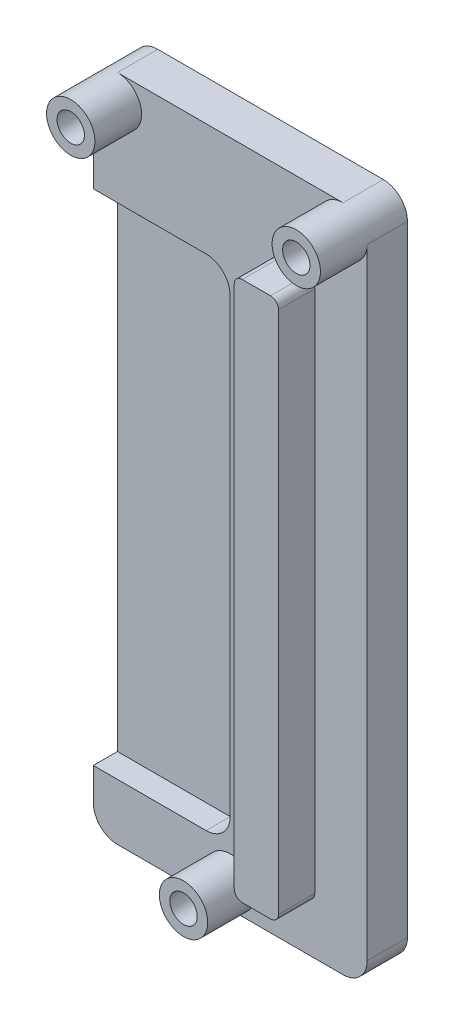
ISO-10303-21;
HEADER;
FILE_DESCRIPTION(('STEP AP214'),'2;1');
FILE_NAME('part.step','',(''),(''),'','','');
FILE_SCHEMA(('AUTOMOTIVE_DESIGN { 1 0 10303 214 1 1 1 1 }'));
ENDSEC;
DATA;
#1=APPLICATION_CONTEXT('core data for automotive mechanical design processes');
#2=APPLICATION_PROTOCOL_DEFINITION('international standard','automotive_design',2000,#1);
#3=PRODUCT_CONTEXT('',#1,'mechanical');
#4=PRODUCT('Part','Part','',(#3));
#5=PRODUCT_RELATED_PRODUCT_CATEGORY('part','',(#4));
#6=PRODUCT_DEFINITION_FORMATION('','',#4);
#7=PRODUCT_DEFINITION_CONTEXT('part definition',#1,'design');
#8=PRODUCT_DEFINITION('design','',#6,#7);
#9=PRODUCT_DEFINITION_SHAPE('','',#8);
#10=(LENGTH_UNIT() NAMED_UNIT(*) SI_UNIT(.MILLI.,.METRE.));
#11=(NAMED_UNIT(*) PLANE_ANGLE_UNIT() SI_UNIT($,.RADIAN.));
#12=(NAMED_UNIT(*) SI_UNIT($,.STERADIAN.) SOLID_ANGLE_UNIT());
#13=UNCERTAINTY_MEASURE_WITH_UNIT(LENGTH_MEASURE(1.E-05),#10,'distance_accuracy_value','');
#14=(GEOMETRIC_REPRESENTATION_CONTEXT(3) GLOBAL_UNCERTAINTY_ASSIGNED_CONTEXT((#13)) GLOBAL_UNIT_ASSIGNED_CONTEXT((#10,
#11,#12)) REPRESENTATION_CONTEXT('',''));
#15=CARTESIAN_POINT('',(0.,0.,0.));
#16=DIRECTION('',(0.,0.,1.));
#17=DIRECTION('',(1.,0.,0.));
#18=AXIS2_PLACEMENT_3D('',#15,#16,#17);
#19=CARTESIAN_POINT('',(3.,3.,5.));
#20=DIRECTION('',(0.,0.,-1.));
#21=DIRECTION('',(-1.,0.,0.));
#22=AXIS2_PLACEMENT_3D('',#19,#20,#21);
#23=PLANE('',#22);
#24=DIRECTION('',(0.,-1.,0.));
#25=VECTOR('',#24,1.);
#26=CARTESIAN_POINT('',(0.,3.,5.));
#27=LINE('',#26,#25);
#28=CARTESIAN_POINT('',(0.,80.,5.));
#29=VERTEX_POINT('',#28);
#30=CARTESIAN_POINT('',(0.,69.,5.));
#31=VERTEX_POINT('',#30);
#32=EDGE_CURVE('E332',#29,#31,#27,.T.);
#33=ORIENTED_EDGE('',*,*,#32,.T.);
#34=DIRECTION('',(-1.,0.,0.));
#35=VECTOR('',#34,1.);
#36=CARTESIAN_POINT('',(14.,69.,5.));
#37=LINE('',#36,#35);
#38=CARTESIAN_POINT('',(14.,69.,5.));
#39=VERTEX_POINT('',#38);
#40=EDGE_CURVE('E207',#39,#31,#37,.T.);
#41=ORIENTED_EDGE('',*,*,#40,.F.);
#42=CARTESIAN_POINT('',(14.,66.,5.));
#43=DIRECTION('',(0.,0.,1.));
#44=DIRECTION('',(-1.,0.,0.));
#45=AXIS2_PLACEMENT_3D('',#42,#43,#44);
#46=CIRCLE('',#45,3.);
#47=CARTESIAN_POINT('',(17.,66.,5.));
#48=VERTEX_POINT('',#47);
#49=EDGE_CURVE('E412',#48,#39,#46,.T.);
#50=ORIENTED_EDGE('',*,*,#49,.F.);
#51=DIRECTION('',(0.,1.,0.));
#52=VECTOR('',#51,1.);
#53=CARTESIAN_POINT('',(17.,66.,5.));
#54=LINE('',#53,#52);
#55=CARTESIAN_POINT('',(17.,10.,5.));
#56=VERTEX_POINT('',#55);
#57=EDGE_CURVE('E415',#56,#48,#54,.T.);
#58=ORIENTED_EDGE('',*,*,#57,.F.);
#59=CARTESIAN_POINT('',(14.,10.,5.));
#60=DIRECTION('',(0.,0.,1.));
#61=DIRECTION('',(-1.,0.,0.));
#62=AXIS2_PLACEMENT_3D('',#59,#60,#61);
#63=CIRCLE('',#62,3.);
#64=CARTESIAN_POINT('',(14.,7.00000000000001,5.));
#65=VERTEX_POINT('',#64);
#66=EDGE_CURVE('E432',#65,#56,#63,.T.);
#67=ORIENTED_EDGE('',*,*,#66,.F.);
#68=DIRECTION('',(1.,0.,0.));
#69=VECTOR('',#68,1.);
#70=CARTESIAN_POINT('',(14.,7.00000000000001,5.));
#71=LINE('',#70,#69);
#72=CARTESIAN_POINT('',(0.,7.00000000000001,5.));
#73=VERTEX_POINT('',#72);
#74=EDGE_CURVE('E434',#73,#65,#71,.T.);
#75=ORIENTED_EDGE('',*,*,#74,.F.);
#76=CARTESIAN_POINT('',(0.,3.,5.));
#77=VERTEX_POINT('',#76);
#78=EDGE_CURVE('E212',#73,#77,#27,.T.);
#79=ORIENTED_EDGE('',*,*,#78,.T.);
#80=CARTESIAN_POINT('',(3.,3.,5.));
#81=DIRECTION('',(0.,0.,1.));
#82=DIRECTION('',(-1.,0.,0.));
#83=AXIS2_PLACEMENT_3D('',#80,#81,#82);
#84=CIRCLE('',#83,3.);
#85=CARTESIAN_POINT('',(3.,0.,5.));
#86=VERTEX_POINT('',#85);
#87=EDGE_CURVE('E317',#77,#86,#84,.T.);
#88=ORIENTED_EDGE('',*,*,#87,.T.);
#89=DIRECTION('',(1.,0.,0.));
#90=VECTOR('',#89,1.);
#91=CARTESIAN_POINT('',(3.,0.,5.));
#92=LINE('',#91,#90);
#93=CARTESIAN_POINT('',(17.,0.,5.));
#94=VERTEX_POINT('',#93);
#95=EDGE_CURVE('E322',#86,#94,#92,.T.);
#96=ORIENTED_EDGE('',*,*,#95,.T.);
#97=CARTESIAN_POINT('',(17.,3.,5.));
#98=DIRECTION('',(0.,0.,1.));
#99=DIRECTION('',(1.,0.,0.));
#100=AXIS2_PLACEMENT_3D('',#97,#98,#99);
#101=CIRCLE('',#100,3.);
#102=EDGE_CURVE('E301',#94,#94,#101,.T.);
#103=ORIENTED_EDGE('',*,*,#102,.F.);
#104=CARTESIAN_POINT('',(31.,0.,5.));
#105=VERTEX_POINT('',#104);
#106=EDGE_CURVE('E320',#94,#105,#92,.T.);
#107=ORIENTED_EDGE('',*,*,#106,.T.);
#108=CARTESIAN_POINT('',(31.,3.,5.));
#109=DIRECTION('',(0.,0.,1.));
#110=DIRECTION('',(1.,0.,0.));
#111=AXIS2_PLACEMENT_3D('',#108,#109,#110);
#112=CIRCLE('',#111,3.);
#113=CARTESIAN_POINT('',(34.,3.,5.));
#114=VERTEX_POINT('',#113);
#115=EDGE_CURVE('E324',#105,#114,#112,.T.);
#116=ORIENTED_EDGE('',*,*,#115,.T.);
#117=DIRECTION('',(0.,1.,0.));
#118=VECTOR('',#117,1.);
#119=CARTESIAN_POINT('',(34.,3.,5.));
#120=LINE('',#119,#118);
#121=CARTESIAN_POINT('',(34.,80.,5.));
#122=VERTEX_POINT('',#121);
#123=EDGE_CURVE('E326',#114,#122,#120,.T.);
#124=ORIENTED_EDGE('',*,*,#123,.T.);
#125=CARTESIAN_POINT('',(31.,80.,5.));
#126=DIRECTION('',(0.,0.,-1.));
#127=DIRECTION('',(-1.,0.,0.));
#128=AXIS2_PLACEMENT_3D('',#125,#126,#127);
#129=CIRCLE('',#128,3.);
#130=CARTESIAN_POINT('',(31.,83.,5.));
#131=VERTEX_POINT('',#130);
#132=EDGE_CURVE('E11',#131,#122,#129,.F.);
#133=ORIENTED_EDGE('',*,*,#132,.F.);
#134=DIRECTION('',(-1.,0.,0.));
#135=VECTOR('',#134,1.);
#136=CARTESIAN_POINT('',(3.,83.,5.));
#137=LINE('',#136,#135);
#138=CARTESIAN_POINT('',(3.,83.,5.));
#139=VERTEX_POINT('',#138);
#140=EDGE_CURVE('E329',#131,#139,#137,.T.);
#141=ORIENTED_EDGE('',*,*,#140,.T.);
#142=CARTESIAN_POINT('',(3.,80.,5.));
#143=DIRECTION('',(0.,0.,1.));
#144=DIRECTION('',(1.,0.,0.));
#145=AXIS2_PLACEMENT_3D('',#142,#143,#144);
#146=CIRCLE('',#145,3.);
#147=EDGE_CURVE('E46',#29,#139,#146,.T.);
#148=ORIENTED_EDGE('',*,*,#147,.F.);
#149=EDGE_LOOP('',(#33,#41,#50,#58,#67,#75,#79,#88,#96,#103,#107,#116,#124,#133,#141,#148));
#150=FACE_BOUND('',#149,.T.);
#151=CARTESIAN_POINT('',(23.,7.,5.));
#152=DIRECTION('',(0.,0.,1.));
#153=DIRECTION('',(1.,0.,0.));
#154=AXIS2_PLACEMENT_3D('',#151,#152,#153);
#155=CIRCLE('',#154,0.999999999999999);
#156=CARTESIAN_POINT('',(22.,7.,5.));
#157=VERTEX_POINT('',#156);
#158=CARTESIAN_POINT('',(23.,6.00000000000001,5.));
#159=VERTEX_POINT('',#158);
#160=EDGE_CURVE('E239',#157,#159,#155,.T.);
#161=ORIENTED_EDGE('',*,*,#160,.F.);
#162=DIRECTION('',(0.,-1.,0.));
#163=VECTOR('',#162,1.);
#164=CARTESIAN_POINT('',(22.,72.,5.));
#165=LINE('',#164,#163);
#166=CARTESIAN_POINT('',(22.,72.,5.));
#167=VERTEX_POINT('',#166);
#168=EDGE_CURVE('E224',#167,#157,#165,.T.);
#169=ORIENTED_EDGE('',*,*,#168,.F.);
#170=CARTESIAN_POINT('',(23.,72.,5.));
#171=DIRECTION('',(0.,0.,1.));
#172=DIRECTION('',(1.,0.,0.));
#173=AXIS2_PLACEMENT_3D('',#170,#171,#172);
#174=CIRCLE('',#173,0.999999999999997);
#175=CARTESIAN_POINT('',(23.,73.,5.));
#176=VERTEX_POINT('',#175);
#177=EDGE_CURVE('E256',#176,#167,#174,.T.);
#178=ORIENTED_EDGE('',*,*,#177,.F.);
#179=DIRECTION('',(-1.,0.,0.));
#180=VECTOR('',#179,1.);
#181=CARTESIAN_POINT('',(23.,73.,5.));
#182=LINE('',#181,#180);
#183=CARTESIAN_POINT('',(26.5,73.,5.));
#184=VERTEX_POINT('',#183);
#185=EDGE_CURVE('E253',#184,#176,#182,.T.);
#186=ORIENTED_EDGE('',*,*,#185,.F.);
#187=CARTESIAN_POINT('',(26.5,72.,5.));
#188=DIRECTION('',(0.,0.,1.));
#189=DIRECTION('',(-1.,0.,0.));
#190=AXIS2_PLACEMENT_3D('',#187,#188,#189);
#191=CIRCLE('',#190,0.999999999999997);
#192=CARTESIAN_POINT('',(27.5,72.,5.));
#193=VERTEX_POINT('',#192);
#194=EDGE_CURVE('E250',#193,#184,#191,.T.);
#195=ORIENTED_EDGE('',*,*,#194,.F.);
#196=DIRECTION('',(0.,1.,0.));
#197=VECTOR('',#196,1.);
#198=CARTESIAN_POINT('',(27.5,72.,5.));
#199=LINE('',#198,#197);
#200=CARTESIAN_POINT('',(27.5,7.,5.));
#201=VERTEX_POINT('',#200);
#202=EDGE_CURVE('E247',#201,#193,#199,.T.);
#203=ORIENTED_EDGE('',*,*,#202,.F.);
#204=CARTESIAN_POINT('',(26.5,7.,5.));
#205=DIRECTION('',(0.,0.,1.));
#206=DIRECTION('',(1.,0.,0.));
#207=AXIS2_PLACEMENT_3D('',#204,#205,#206);
#208=CIRCLE('',#207,0.999999999999999);
#209=CARTESIAN_POINT('',(26.5,6.,5.));
#210=VERTEX_POINT('',#209);
#211=EDGE_CURVE('E244',#210,#201,#208,.T.);
#212=ORIENTED_EDGE('',*,*,#211,.F.);
#213=DIRECTION('',(1.,0.,0.));
#214=VECTOR('',#213,1.);
#215=CARTESIAN_POINT('',(23.,6.00000000000001,5.));
#216=LINE('',#215,#214);
#217=EDGE_CURVE('E61',#159,#210,#216,.T.);
#218=ORIENTED_EDGE('',*,*,#217,.F.);
#219=EDGE_LOOP('',(#161,#169,#178,#186,#195,#203,#212,#218));
#220=FACE_BOUND('',#219,.T.);
#221=ADVANCED_FACE('F38',(#150,#220),#23,.F.);
#222=CARTESIAN_POINT('',(3.,3.,0.));
#223=DIRECTION('',(0.,0.,-1.));
#224=DIRECTION('',(-1.,0.,0.));
#225=AXIS2_PLACEMENT_3D('',#222,#223,#224);
#226=PLANE('',#225);
#227=CARTESIAN_POINT('',(17.,3.,0.));
#228=DIRECTION('',(0.,0.,1.));
#229=DIRECTION('',(1.,0.,0.));
#230=AXIS2_PLACEMENT_3D('',#227,#228,#229);
#231=CIRCLE('',#230,1.7);
#232=CARTESIAN_POINT('',(18.7,3.,0.));
#233=VERTEX_POINT('',#232);
#234=EDGE_CURVE('E298',#233,#233,#231,.T.);
#235=ORIENTED_EDGE('',*,*,#234,.T.);
#236=EDGE_LOOP('',(#235));
#237=FACE_BOUND('',#236,.T.);
#238=CARTESIAN_POINT('',(3.,3.,0.));
#239=DIRECTION('',(0.,0.,1.));
#240=DIRECTION('',(-1.,0.,0.));
#241=AXIS2_PLACEMENT_3D('',#238,#239,#240);
#242=CIRCLE('',#241,3.);
#243=CARTESIAN_POINT('',(0.,3.,0.));
#244=VERTEX_POINT('',#243);
#245=CARTESIAN_POINT('',(3.,0.,0.));
#246=VERTEX_POINT('',#245);
#247=EDGE_CURVE('E313',#244,#246,#242,.T.);
#248=ORIENTED_EDGE('',*,*,#247,.F.);
#249=DIRECTION('',(0.,-1.,0.));
#250=VECTOR('',#249,1.);
#251=CARTESIAN_POINT('',(0.,3.,0.));
#252=LINE('',#251,#250);
#253=CARTESIAN_POINT('',(0.,80.,0.));
#254=VERTEX_POINT('',#253);
#255=EDGE_CURVE('E321',#254,#244,#252,.T.);
#256=ORIENTED_EDGE('',*,*,#255,.F.);
#257=CARTESIAN_POINT('',(3.,80.,0.));
#258=DIRECTION('',(0.,0.,1.));
#259=DIRECTION('',(-1.,0.,0.));
#260=AXIS2_PLACEMENT_3D('',#257,#258,#259);
#261=CIRCLE('',#260,3.);
#262=CARTESIAN_POINT('',(3.,83.,0.));
#263=VERTEX_POINT('',#262);
#264=EDGE_CURVE('E348',#263,#254,#261,.T.);
#265=ORIENTED_EDGE('',*,*,#264,.F.);
#266=DIRECTION('',(-1.,0.,0.));
#267=VECTOR('',#266,1.);
#268=CARTESIAN_POINT('',(3.,83.,0.));
#269=LINE('',#268,#267);
#270=CARTESIAN_POINT('',(31.,83.,0.));
#271=VERTEX_POINT('',#270);
#272=EDGE_CURVE('E346',#271,#263,#269,.T.);
#273=ORIENTED_EDGE('',*,*,#272,.F.);
#274=CARTESIAN_POINT('',(31.,80.,0.));
#275=DIRECTION('',(0.,0.,1.));
#276=DIRECTION('',(1.,0.,0.));
#277=AXIS2_PLACEMENT_3D('',#274,#275,#276);
#278=CIRCLE('',#277,3.);
#279=CARTESIAN_POINT('',(34.,80.,0.));
#280=VERTEX_POINT('',#279);
#281=EDGE_CURVE('E344',#280,#271,#278,.T.);
#282=ORIENTED_EDGE('',*,*,#281,.F.);
#283=DIRECTION('',(0.,1.,0.));
#284=VECTOR('',#283,1.);
#285=CARTESIAN_POINT('',(34.,3.,0.));
#286=LINE('',#285,#284);
#287=CARTESIAN_POINT('',(34.,3.,0.));
#288=VERTEX_POINT('',#287);
#289=EDGE_CURVE('E342',#288,#280,#286,.T.);
#290=ORIENTED_EDGE('',*,*,#289,.F.);
#291=CARTESIAN_POINT('',(31.,3.,0.));
#292=DIRECTION('',(0.,0.,1.));
#293=DIRECTION('',(1.,0.,0.));
#294=AXIS2_PLACEMENT_3D('',#291,#292,#293);
#295=CIRCLE('',#294,3.);
#296=CARTESIAN_POINT('',(31.,0.,0.));
#297=VERTEX_POINT('',#296);
#298=EDGE_CURVE('E340',#297,#288,#295,.T.);
#299=ORIENTED_EDGE('',*,*,#298,.F.);
#300=DIRECTION('',(1.,0.,0.));
#301=VECTOR('',#300,1.);
#302=CARTESIAN_POINT('',(3.,0.,0.));
#303=LINE('',#302,#301);
#304=EDGE_CURVE('E338',#246,#297,#303,.T.);
#305=ORIENTED_EDGE('',*,*,#304,.F.);
#306=EDGE_LOOP('',(#248,#256,#265,#273,#282,#290,#299,#305));
#307=FACE_BOUND('',#306,.T.);
#308=CARTESIAN_POINT('',(31.,80.,0.));
#309=DIRECTION('',(0.,0.,1.));
#310=DIRECTION('',(1.,0.,0.));
#311=AXIS2_PLACEMENT_3D('',#308,#309,#310);
#312=CIRCLE('',#311,1.7);
#313=CARTESIAN_POINT('',(32.7,80.,0.));
#314=VERTEX_POINT('',#313);
#315=EDGE_CURVE('E292',#314,#314,#312,.T.);
#316=ORIENTED_EDGE('',*,*,#315,.T.);
#317=EDGE_LOOP('',(#316));
#318=FACE_BOUND('',#317,.T.);
#319=CARTESIAN_POINT('',(3.,80.,0.));
#320=DIRECTION('',(0.,0.,1.));
#321=DIRECTION('',(1.,0.,0.));
#322=AXIS2_PLACEMENT_3D('',#319,#320,#321);
#323=CIRCLE('',#322,1.7);
#324=CARTESIAN_POINT('',(4.7,80.,0.));
#325=VERTEX_POINT('',#324);
#326=EDGE_CURVE('E286',#325,#325,#323,.T.);
#327=ORIENTED_EDGE('',*,*,#326,.T.);
#328=EDGE_LOOP('',(#327));
#329=FACE_BOUND('',#328,.T.);
#330=ADVANCED_FACE('F381',(#237,#307,#318,#329),#226,.T.);
#331=CARTESIAN_POINT('',(3.,3.,5.));
#332=DIRECTION('',(0.,0.,-1.));
#333=DIRECTION('',(-1.,0.,0.));
#334=AXIS2_PLACEMENT_3D('',#331,#332,#333);
#335=CYLINDRICAL_SURFACE('',#334,3.);
#336=ORIENTED_EDGE('',*,*,#247,.T.);
#337=DIRECTION('',(0.,0.,-1.));
#338=VECTOR('',#337,1.);
#339=CARTESIAN_POINT('',(3.,0.,5.));
#340=LINE('',#339,#338);
#341=EDGE_CURVE('E316',#86,#246,#340,.T.);
#342=ORIENTED_EDGE('',*,*,#341,.F.);
#343=ORIENTED_EDGE('',*,*,#87,.F.);
#344=DIRECTION('',(0.,0.,-1.));
#345=VECTOR('',#344,1.);
#346=CARTESIAN_POINT('',(0.,3.,5.));
#347=LINE('',#346,#345);
#348=EDGE_CURVE('E335',#77,#244,#347,.T.);
#349=ORIENTED_EDGE('',*,*,#348,.T.);
#350=EDGE_LOOP('',(#336,#342,#343,#349));
#351=FACE_BOUND('',#350,.T.);
#352=ADVANCED_FACE('F40',(#351),#335,.T.);
#353=CARTESIAN_POINT('',(3.,0.,5.));
#354=DIRECTION('',(0.,1.,0.));
#355=DIRECTION('',(0.,0.,1.));
#356=AXIS2_PLACEMENT_3D('',#353,#354,#355);
#357=PLANE('',#356);
#358=ORIENTED_EDGE('',*,*,#304,.T.);
#359=DIRECTION('',(0.,0.,-1.));
#360=VECTOR('',#359,1.);
#361=CARTESIAN_POINT('',(31.,0.,5.));
#362=LINE('',#361,#360);
#363=EDGE_CURVE('E368',#105,#297,#362,.T.);
#364=ORIENTED_EDGE('',*,*,#363,.F.);
#365=ORIENTED_EDGE('',*,*,#106,.F.);
#366=ORIENTED_EDGE('',*,*,#95,.F.);
#367=ORIENTED_EDGE('',*,*,#341,.T.);
#368=EDGE_LOOP('',(#358,#364,#365,#366,#367));
#369=FACE_BOUND('',#368,.T.);
#370=ADVANCED_FACE('F373',(#369),#357,.F.);
#371=CARTESIAN_POINT('',(31.,3.,5.));
#372=DIRECTION('',(0.,0.,-1.));
#373=DIRECTION('',(-1.,0.,0.));
#374=AXIS2_PLACEMENT_3D('',#371,#372,#373);
#375=CYLINDRICAL_SURFACE('',#374,3.);
#376=ORIENTED_EDGE('',*,*,#298,.T.);
#377=DIRECTION('',(0.,0.,-1.));
#378=VECTOR('',#377,1.);
#379=CARTESIAN_POINT('',(34.,3.,5.));
#380=LINE('',#379,#378);
#381=EDGE_CURVE('E365',#114,#288,#380,.T.);
#382=ORIENTED_EDGE('',*,*,#381,.F.);
#383=ORIENTED_EDGE('',*,*,#115,.F.);
#384=ORIENTED_EDGE('',*,*,#363,.T.);
#385=EDGE_LOOP('',(#376,#382,#383,#384));
#386=FACE_BOUND('',#385,.T.);
#387=ADVANCED_FACE('F389',(#386),#375,.T.);
#388=CARTESIAN_POINT('',(34.,3.,5.));
#389=DIRECTION('',(-1.,0.,0.));
#390=DIRECTION('',(0.,-1.,0.));
#391=AXIS2_PLACEMENT_3D('',#388,#389,#390);
#392=PLANE('',#391);
#393=ORIENTED_EDGE('',*,*,#289,.T.);
#394=DIRECTION('',(0.,0.,-1.));
#395=VECTOR('',#394,1.);
#396=CARTESIAN_POINT('',(34.,80.,5.));
#397=LINE('',#396,#395);
#398=EDGE_CURVE('E362',#122,#280,#397,.T.);
#399=ORIENTED_EDGE('',*,*,#398,.F.);
#400=ORIENTED_EDGE('',*,*,#123,.F.);
#401=ORIENTED_EDGE('',*,*,#381,.T.);
#402=EDGE_LOOP('',(#393,#399,#400,#401));
#403=FACE_BOUND('',#402,.T.);
#404=ADVANCED_FACE('F393',(#403),#392,.F.);
#405=CARTESIAN_POINT('',(31.,80.,5.));
#406=DIRECTION('',(0.,0.,-1.));
#407=DIRECTION('',(-1.,0.,0.));
#408=AXIS2_PLACEMENT_3D('',#405,#406,#407);
#409=CYLINDRICAL_SURFACE('',#408,3.);
#410=ORIENTED_EDGE('',*,*,#281,.T.);
#411=DIRECTION('',(0.,0.,-1.));
#412=VECTOR('',#411,1.);
#413=CARTESIAN_POINT('',(31.,83.,5.));
#414=LINE('',#413,#412);
#415=EDGE_CURVE('E359',#131,#271,#414,.T.);
#416=ORIENTED_EDGE('',*,*,#415,.F.);
#417=ORIENTED_EDGE('',*,*,#132,.T.);
#418=ORIENTED_EDGE('',*,*,#398,.T.);
#419=EDGE_LOOP('',(#410,#416,#417,#418));
#420=FACE_BOUND('',#419,.T.);
#421=CARTESIAN_POINT('',(31.,80.,10.8));
#422=DIRECTION('',(0.,0.,1.));
#423=DIRECTION('',(1.,0.,0.));
#424=AXIS2_PLACEMENT_3D('',#421,#422,#423);
#425=CIRCLE('',#424,3.);
#426=CARTESIAN_POINT('',(34.,80.,10.8));
#427=VERTEX_POINT('',#426);
#428=EDGE_CURVE('E305',#427,#427,#425,.T.);
#429=ORIENTED_EDGE('',*,*,#428,.F.);
#430=EDGE_LOOP('',(#429));
#431=FACE_BOUND('',#430,.T.);
#432=ADVANCED_FACE('F397',(#420,#431),#409,.T.);
#433=CARTESIAN_POINT('',(3.,83.,5.));
#434=DIRECTION('',(0.,-1.,0.));
#435=DIRECTION('',(0.,0.,-1.));
#436=AXIS2_PLACEMENT_3D('',#433,#434,#435);
#437=PLANE('',#436);
#438=ORIENTED_EDGE('',*,*,#272,.T.);
#439=DIRECTION('',(0.,0.,-1.));
#440=VECTOR('',#439,1.);
#441=CARTESIAN_POINT('',(3.,83.,5.));
#442=LINE('',#441,#440);
#443=EDGE_CURVE('E356',#139,#263,#442,.T.);
#444=ORIENTED_EDGE('',*,*,#443,.F.);
#445=ORIENTED_EDGE('',*,*,#140,.F.);
#446=ORIENTED_EDGE('',*,*,#415,.T.);
#447=EDGE_LOOP('',(#438,#444,#445,#446));
#448=FACE_BOUND('',#447,.T.);
#449=ADVANCED_FACE('F402',(#448),#437,.F.);
#450=CARTESIAN_POINT('',(3.,80.,5.));
#451=DIRECTION('',(0.,0.,-1.));
#452=DIRECTION('',(-1.,0.,0.));
#453=AXIS2_PLACEMENT_3D('',#450,#451,#452);
#454=CYLINDRICAL_SURFACE('',#453,3.);
#455=ORIENTED_EDGE('',*,*,#264,.T.);
#456=DIRECTION('',(0.,0.,-1.));
#457=VECTOR('',#456,1.);
#458=CARTESIAN_POINT('',(0.,80.,5.));
#459=LINE('',#458,#457);
#460=EDGE_CURVE('E353',#29,#254,#459,.T.);
#461=ORIENTED_EDGE('',*,*,#460,.F.);
#462=ORIENTED_EDGE('',*,*,#147,.T.);
#463=ORIENTED_EDGE('',*,*,#443,.T.);
#464=EDGE_LOOP('',(#455,#461,#462,#463));
#465=FACE_BOUND('',#464,.T.);
#466=CARTESIAN_POINT('',(3.,80.,10.8));
#467=DIRECTION('',(0.,0.,1.));
#468=DIRECTION('',(1.,0.,0.));
#469=AXIS2_PLACEMENT_3D('',#466,#467,#468);
#470=CIRCLE('',#469,3.);
#471=CARTESIAN_POINT('',(6.00000000000001,80.,10.8));
#472=VERTEX_POINT('',#471);
#473=EDGE_CURVE('E310',#472,#472,#470,.T.);
#474=ORIENTED_EDGE('',*,*,#473,.F.);
#475=EDGE_LOOP('',(#474));
#476=FACE_BOUND('',#475,.T.);
#477=ADVANCED_FACE('F405',(#465,#476),#454,.T.);
#478=CARTESIAN_POINT('',(0.,3.,5.));
#479=DIRECTION('',(1.,0.,0.));
#480=DIRECTION('',(0.,0.,-1.));
#481=AXIS2_PLACEMENT_3D('',#478,#479,#480);
#482=PLANE('',#481);
#483=DIRECTION('',(0.,-1.,0.));
#484=VECTOR('',#483,1.);
#485=CARTESIAN_POINT('',(0.,69.,2.));
#486=LINE('',#485,#484);
#487=CARTESIAN_POINT('',(0.,69.,2.));
#488=VERTEX_POINT('',#487);
#489=CARTESIAN_POINT('',(0.,7.00000000000001,2.));
#490=VERTEX_POINT('',#489);
#491=EDGE_CURVE('E201',#488,#490,#486,.T.);
#492=ORIENTED_EDGE('',*,*,#491,.F.);
#493=DIRECTION('',(0.,0.,1.));
#494=VECTOR('',#493,1.);
#495=CARTESIAN_POINT('',(0.,69.,2.));
#496=LINE('',#495,#494);
#497=EDGE_CURVE('E242',#488,#31,#496,.T.);
#498=ORIENTED_EDGE('',*,*,#497,.T.);
#499=ORIENTED_EDGE('',*,*,#32,.F.);
#500=ORIENTED_EDGE('',*,*,#460,.T.);
#501=ORIENTED_EDGE('',*,*,#255,.T.);
#502=ORIENTED_EDGE('',*,*,#348,.F.);
#503=ORIENTED_EDGE('',*,*,#78,.F.);
#504=DIRECTION('',(0.,0.,1.));
#505=VECTOR('',#504,1.);
#506=CARTESIAN_POINT('',(0.,7.00000000000001,2.));
#507=LINE('',#506,#505);
#508=EDGE_CURVE('E195',#490,#73,#507,.T.);
#509=ORIENTED_EDGE('',*,*,#508,.F.);
#510=EDGE_LOOP('',(#492,#498,#499,#500,#501,#502,#503,#509));
#511=FACE_BOUND('',#510,.T.);
#512=ADVANCED_FACE('F210',(#511),#482,.F.);
#513=CARTESIAN_POINT('',(3.,80.,10.8));
#514=DIRECTION('',(0.,0.,1.));
#515=DIRECTION('',(1.,0.,0.));
#516=AXIS2_PLACEMENT_3D('',#513,#514,#515);
#517=PLANE('',#516);
#518=CARTESIAN_POINT('',(3.,80.,10.8));
#519=DIRECTION('',(0.,0.,1.));
#520=DIRECTION('',(1.,0.,0.));
#521=AXIS2_PLACEMENT_3D('',#518,#519,#520);
#522=CIRCLE('',#521,1.69999999999999);
#523=CARTESIAN_POINT('',(4.69999999999999,80.,10.8));
#524=VERTEX_POINT('',#523);
#525=EDGE_CURVE('E283',#524,#524,#522,.T.);
#526=ORIENTED_EDGE('',*,*,#525,.F.);
#527=EDGE_LOOP('',(#526));
#528=FACE_BOUND('',#527,.T.);
#529=ORIENTED_EDGE('',*,*,#473,.T.);
#530=EDGE_LOOP('',(#529));
#531=FACE_BOUND('',#530,.T.);
#532=ADVANCED_FACE('F463',(#528,#531),#517,.T.);
#533=CARTESIAN_POINT('',(31.,80.,10.8));
#534=DIRECTION('',(0.,0.,1.));
#535=DIRECTION('',(1.,0.,0.));
#536=AXIS2_PLACEMENT_3D('',#533,#534,#535);
#537=PLANE('',#536);
#538=CARTESIAN_POINT('',(31.,80.,10.8));
#539=DIRECTION('',(0.,0.,1.));
#540=DIRECTION('',(1.,0.,0.));
#541=AXIS2_PLACEMENT_3D('',#538,#539,#540);
#542=CIRCLE('',#541,1.69999999999999);
#543=CARTESIAN_POINT('',(32.7,80.,10.8));
#544=VERTEX_POINT('',#543);
#545=EDGE_CURVE('E289',#544,#544,#542,.T.);
#546=ORIENTED_EDGE('',*,*,#545,.F.);
#547=EDGE_LOOP('',(#546));
#548=FACE_BOUND('',#547,.T.);
#549=ORIENTED_EDGE('',*,*,#428,.T.);
#550=EDGE_LOOP('',(#549));
#551=FACE_BOUND('',#550,.T.);
#552=ADVANCED_FACE('F637',(#548,#551),#537,.T.);
#553=CARTESIAN_POINT('',(17.,3.,10.8));
#554=DIRECTION('',(0.,0.,-1.));
#555=DIRECTION('',(-1.,0.,0.));
#556=AXIS2_PLACEMENT_3D('',#553,#554,#555);
#557=CYLINDRICAL_SURFACE('',#556,3.);
#558=CARTESIAN_POINT('',(17.,3.,10.8));
#559=DIRECTION('',(0.,0.,1.));
#560=DIRECTION('',(1.,0.,0.));
#561=AXIS2_PLACEMENT_3D('',#558,#559,#560);
#562=CIRCLE('',#561,3.);
#563=CARTESIAN_POINT('',(20.,3.,10.8));
#564=VERTEX_POINT('',#563);
#565=EDGE_CURVE('E302',#564,#564,#562,.T.);
#566=ORIENTED_EDGE('',*,*,#565,.F.);
#567=EDGE_LOOP('',(#566));
#568=FACE_BOUND('',#567,.T.);
#569=ORIENTED_EDGE('',*,*,#102,.T.);
#570=EDGE_LOOP('',(#569));
#571=FACE_BOUND('',#570,.T.);
#572=ADVANCED_FACE('F634',(#568,#571),#557,.T.);
#573=CARTESIAN_POINT('',(17.,3.,10.8));
#574=DIRECTION('',(0.,0.,1.));
#575=DIRECTION('',(1.,0.,0.));
#576=AXIS2_PLACEMENT_3D('',#573,#574,#575);
#577=PLANE('',#576);
#578=CARTESIAN_POINT('',(17.,3.,10.8));
#579=DIRECTION('',(0.,0.,1.));
#580=DIRECTION('',(1.,0.,0.));
#581=AXIS2_PLACEMENT_3D('',#578,#579,#580);
#582=CIRCLE('',#581,1.69999999999999);
#583=CARTESIAN_POINT('',(18.7,3.,10.8));
#584=VERTEX_POINT('',#583);
#585=EDGE_CURVE('E295',#584,#584,#582,.T.);
#586=ORIENTED_EDGE('',*,*,#585,.F.);
#587=EDGE_LOOP('',(#586));
#588=FACE_BOUND('',#587,.T.);
#589=ORIENTED_EDGE('',*,*,#565,.T.);
#590=EDGE_LOOP('',(#589));
#591=FACE_BOUND('',#590,.T.);
#592=ADVANCED_FACE('F630',(#588,#591),#577,.T.);
#593=CARTESIAN_POINT('',(17.,3.,10.8));
#594=DIRECTION('',(0.,0.,1.));
#595=DIRECTION('',(1.,0.,0.));
#596=AXIS2_PLACEMENT_3D('',#593,#594,#595);
#597=CYLINDRICAL_SURFACE('',#596,1.69999999999999);
#598=ORIENTED_EDGE('',*,*,#234,.F.);
#599=EDGE_LOOP('',(#598));
#600=FACE_BOUND('',#599,.T.);
#601=ORIENTED_EDGE('',*,*,#585,.T.);
#602=EDGE_LOOP('',(#601));
#603=FACE_BOUND('',#602,.T.);
#604=ADVANCED_FACE('F626',(#600,#603),#597,.F.);
#605=CARTESIAN_POINT('',(31.,80.,10.8));
#606=DIRECTION('',(0.,0.,1.));
#607=DIRECTION('',(1.,0.,0.));
#608=AXIS2_PLACEMENT_3D('',#605,#606,#607);
#609=CYLINDRICAL_SURFACE('',#608,1.69999999999999);
#610=ORIENTED_EDGE('',*,*,#315,.F.);
#611=EDGE_LOOP('',(#610));
#612=FACE_BOUND('',#611,.T.);
#613=ORIENTED_EDGE('',*,*,#545,.T.);
#614=EDGE_LOOP('',(#613));
#615=FACE_BOUND('',#614,.T.);
#616=ADVANCED_FACE('F622',(#612,#615),#609,.F.);
#617=CARTESIAN_POINT('',(3.,80.,10.8));
#618=DIRECTION('',(0.,0.,1.));
#619=DIRECTION('',(1.,0.,0.));
#620=AXIS2_PLACEMENT_3D('',#617,#618,#619);
#621=CYLINDRICAL_SURFACE('',#620,1.69999999999999);
#622=ORIENTED_EDGE('',*,*,#326,.F.);
#623=EDGE_LOOP('',(#622));
#624=FACE_BOUND('',#623,.T.);
#625=ORIENTED_EDGE('',*,*,#525,.T.);
#626=EDGE_LOOP('',(#625));
#627=FACE_BOUND('',#626,.T.);
#628=ADVANCED_FACE('F497',(#624,#627),#621,.F.);
#629=CARTESIAN_POINT('',(23.,7.,9.5));
#630=DIRECTION('',(0.,0.,-1.));
#631=DIRECTION('',(-1.,0.,0.));
#632=AXIS2_PLACEMENT_3D('',#629,#630,#631);
#633=CYLINDRICAL_SURFACE('',#632,0.999999999999999);
#634=ORIENTED_EDGE('',*,*,#160,.T.);
#635=DIRECTION('',(0.,0.,-1.));
#636=VECTOR('',#635,1.);
#637=CARTESIAN_POINT('',(23.,6.00000000000001,9.5));
#638=LINE('',#637,#636);
#639=CARTESIAN_POINT('',(23.,6.00000000000001,9.5));
#640=VERTEX_POINT('',#639);
#641=EDGE_CURVE('E281',#640,#159,#638,.T.);
#642=ORIENTED_EDGE('',*,*,#641,.F.);
#643=CARTESIAN_POINT('',(23.,7.,9.5));
#644=DIRECTION('',(0.,0.,1.));
#645=DIRECTION('',(1.,0.,0.));
#646=AXIS2_PLACEMENT_3D('',#643,#644,#645);
#647=CIRCLE('',#646,0.999999999999999);
#648=CARTESIAN_POINT('',(22.,7.,9.5));
#649=VERTEX_POINT('',#648);
#650=EDGE_CURVE('E220',#649,#640,#647,.T.);
#651=ORIENTED_EDGE('',*,*,#650,.F.);
#652=DIRECTION('',(0.,0.,-1.));
#653=VECTOR('',#652,1.);
#654=CARTESIAN_POINT('',(22.,7.,9.5));
#655=LINE('',#654,#653);
#656=EDGE_CURVE('E238',#649,#157,#655,.T.);
#657=ORIENTED_EDGE('',*,*,#656,.T.);
#658=EDGE_LOOP('',(#634,#642,#651,#657));
#659=FACE_BOUND('',#658,.T.);
#660=ADVANCED_FACE('F502',(#659),#633,.T.);
#661=CARTESIAN_POINT('',(23.,6.00000000000001,9.5));
#662=DIRECTION('',(0.,1.,0.));
#663=DIRECTION('',(-1.,0.,0.));
#664=AXIS2_PLACEMENT_3D('',#661,#662,#663);
#665=PLANE('',#664);
#666=ORIENTED_EDGE('',*,*,#217,.T.);
#667=DIRECTION('',(0.,0.,-1.));
#668=VECTOR('',#667,1.);
#669=CARTESIAN_POINT('',(26.5,6.,9.5));
#670=LINE('',#669,#668);
#671=CARTESIAN_POINT('',(26.5,6.,9.5));
#672=VERTEX_POINT('',#671);
#673=EDGE_CURVE('E278',#672,#210,#670,.T.);
#674=ORIENTED_EDGE('',*,*,#673,.F.);
#675=DIRECTION('',(1.,0.,0.));
#676=VECTOR('',#675,1.);
#677=CARTESIAN_POINT('',(23.,6.00000000000001,9.5));
#678=LINE('',#677,#676);
#679=EDGE_CURVE('E223',#640,#672,#678,.T.);
#680=ORIENTED_EDGE('',*,*,#679,.F.);
#681=ORIENTED_EDGE('',*,*,#641,.T.);
#682=EDGE_LOOP('',(#666,#674,#680,#681));
#683=FACE_BOUND('',#682,.T.);
#684=ADVANCED_FACE('F508',(#683),#665,.F.);
#685=CARTESIAN_POINT('',(26.5,7.,9.5));
#686=DIRECTION('',(0.,0.,-1.));
#687=DIRECTION('',(-1.,0.,0.));
#688=AXIS2_PLACEMENT_3D('',#685,#686,#687);
#689=CYLINDRICAL_SURFACE('',#688,0.999999999999999);
#690=ORIENTED_EDGE('',*,*,#211,.T.);
#691=DIRECTION('',(0.,0.,-1.));
#692=VECTOR('',#691,1.);
#693=CARTESIAN_POINT('',(27.5,7.,9.5));
#694=LINE('',#693,#692);
#695=CARTESIAN_POINT('',(27.5,7.,9.5));
#696=VERTEX_POINT('',#695);
#697=EDGE_CURVE('E275',#696,#201,#694,.T.);
#698=ORIENTED_EDGE('',*,*,#697,.F.);
#699=CARTESIAN_POINT('',(26.5,7.,9.5));
#700=DIRECTION('',(0.,0.,1.));
#701=DIRECTION('',(1.,0.,0.));
#702=AXIS2_PLACEMENT_3D('',#699,#700,#701);
#703=CIRCLE('',#702,0.999999999999999);
#704=EDGE_CURVE('E226',#672,#696,#703,.T.);
#705=ORIENTED_EDGE('',*,*,#704,.F.);
#706=ORIENTED_EDGE('',*,*,#673,.T.);
#707=EDGE_LOOP('',(#690,#698,#705,#706));
#708=FACE_BOUND('',#707,.T.);
#709=ADVANCED_FACE('F517',(#708),#689,.T.);
#710=CARTESIAN_POINT('',(27.5,72.,9.5));
#711=DIRECTION('',(-1.,0.,0.));
#712=DIRECTION('',(0.,-1.,0.));
#713=AXIS2_PLACEMENT_3D('',#710,#711,#712);
#714=PLANE('',#713);
#715=ORIENTED_EDGE('',*,*,#202,.T.);
#716=DIRECTION('',(0.,0.,-1.));
#717=VECTOR('',#716,1.);
#718=CARTESIAN_POINT('',(27.5,72.,9.5));
#719=LINE('',#718,#717);
#720=CARTESIAN_POINT('',(27.5,72.,9.5));
#721=VERTEX_POINT('',#720);
#722=EDGE_CURVE('E272',#721,#193,#719,.T.);
#723=ORIENTED_EDGE('',*,*,#722,.F.);
#724=DIRECTION('',(0.,1.,0.));
#725=VECTOR('',#724,1.);
#726=CARTESIAN_POINT('',(27.5,72.,9.5));
#727=LINE('',#726,#725);
#728=EDGE_CURVE('E228',#696,#721,#727,.T.);
#729=ORIENTED_EDGE('',*,*,#728,.F.);
#730=ORIENTED_EDGE('',*,*,#697,.T.);
#731=EDGE_LOOP('',(#715,#723,#729,#730));
#732=FACE_BOUND('',#731,.T.);
#733=ADVANCED_FACE('F526',(#732),#714,.F.);
#734=CARTESIAN_POINT('',(26.5,72.,9.5));
#735=DIRECTION('',(0.,0.,-1.));
#736=DIRECTION('',(-1.,0.,0.));
#737=AXIS2_PLACEMENT_3D('',#734,#735,#736);
#738=CYLINDRICAL_SURFACE('',#737,0.999999999999997);
#739=ORIENTED_EDGE('',*,*,#194,.T.);
#740=DIRECTION('',(0.,0.,-1.));
#741=VECTOR('',#740,1.);
#742=CARTESIAN_POINT('',(26.5,73.,9.5));
#743=LINE('',#742,#741);
#744=CARTESIAN_POINT('',(26.5,73.,9.5));
#745=VERTEX_POINT('',#744);
#746=EDGE_CURVE('E269',#745,#184,#743,.T.);
#747=ORIENTED_EDGE('',*,*,#746,.F.);
#748=CARTESIAN_POINT('',(26.5,72.,9.5));
#749=DIRECTION('',(0.,0.,1.));
#750=DIRECTION('',(-1.,0.,0.));
#751=AXIS2_PLACEMENT_3D('',#748,#749,#750);
#752=CIRCLE('',#751,0.999999999999997);
#753=EDGE_CURVE('E230',#721,#745,#752,.T.);
#754=ORIENTED_EDGE('',*,*,#753,.F.);
#755=ORIENTED_EDGE('',*,*,#722,.T.);
#756=EDGE_LOOP('',(#739,#747,#754,#755));
#757=FACE_BOUND('',#756,.T.);
#758=ADVANCED_FACE('F535',(#757),#738,.T.);
#759=CARTESIAN_POINT('',(23.,73.,9.5));
#760=DIRECTION('',(0.,-1.,0.));
#761=DIRECTION('',(0.,0.,-1.));
#762=AXIS2_PLACEMENT_3D('',#759,#760,#761);
#763=PLANE('',#762);
#764=ORIENTED_EDGE('',*,*,#185,.T.);
#765=DIRECTION('',(0.,0.,-1.));
#766=VECTOR('',#765,1.);
#767=CARTESIAN_POINT('',(23.,73.,9.5));
#768=LINE('',#767,#766);
#769=CARTESIAN_POINT('',(23.,73.,9.5));
#770=VERTEX_POINT('',#769);
#771=EDGE_CURVE('E266',#770,#176,#768,.T.);
#772=ORIENTED_EDGE('',*,*,#771,.F.);
#773=DIRECTION('',(-1.,0.,0.));
#774=VECTOR('',#773,1.);
#775=CARTESIAN_POINT('',(23.,73.,9.5));
#776=LINE('',#775,#774);
#777=EDGE_CURVE('E232',#745,#770,#776,.T.);
#778=ORIENTED_EDGE('',*,*,#777,.F.);
#779=ORIENTED_EDGE('',*,*,#746,.T.);
#780=EDGE_LOOP('',(#764,#772,#778,#779));
#781=FACE_BOUND('',#780,.T.);
#782=ADVANCED_FACE('F544',(#781),#763,.F.);
#783=CARTESIAN_POINT('',(23.,72.,9.5));
#784=DIRECTION('',(0.,0.,-1.));
#785=DIRECTION('',(-1.,0.,0.));
#786=AXIS2_PLACEMENT_3D('',#783,#784,#785);
#787=CYLINDRICAL_SURFACE('',#786,0.999999999999997);
#788=ORIENTED_EDGE('',*,*,#177,.T.);
#789=DIRECTION('',(0.,0.,-1.));
#790=VECTOR('',#789,1.);
#791=CARTESIAN_POINT('',(22.,72.,9.5));
#792=LINE('',#791,#790);
#793=CARTESIAN_POINT('',(22.,72.,9.5));
#794=VERTEX_POINT('',#793);
#795=EDGE_CURVE('E263',#794,#167,#792,.T.);
#796=ORIENTED_EDGE('',*,*,#795,.F.);
#797=CARTESIAN_POINT('',(23.,72.,9.5));
#798=DIRECTION('',(0.,0.,1.));
#799=DIRECTION('',(1.,0.,0.));
#800=AXIS2_PLACEMENT_3D('',#797,#798,#799);
#801=CIRCLE('',#800,0.999999999999997);
#802=EDGE_CURVE('E234',#770,#794,#801,.T.);
#803=ORIENTED_EDGE('',*,*,#802,.F.);
#804=ORIENTED_EDGE('',*,*,#771,.T.);
#805=EDGE_LOOP('',(#788,#796,#803,#804));
#806=FACE_BOUND('',#805,.T.);
#807=ADVANCED_FACE('F553',(#806),#787,.T.);
#808=CARTESIAN_POINT('',(22.,72.,9.5));
#809=DIRECTION('',(1.,0.,0.));
#810=DIRECTION('',(0.,1.,0.));
#811=AXIS2_PLACEMENT_3D('',#808,#809,#810);
#812=PLANE('',#811);
#813=ORIENTED_EDGE('',*,*,#168,.T.);
#814=ORIENTED_EDGE('',*,*,#656,.F.);
#815=DIRECTION('',(0.,-1.,0.));
#816=VECTOR('',#815,1.);
#817=CARTESIAN_POINT('',(22.,72.,9.5));
#818=LINE('',#817,#816);
#819=EDGE_CURVE('E236',#794,#649,#818,.T.);
#820=ORIENTED_EDGE('',*,*,#819,.F.);
#821=ORIENTED_EDGE('',*,*,#795,.T.);
#822=EDGE_LOOP('',(#813,#814,#820,#821));
#823=FACE_BOUND('',#822,.T.);
#824=ADVANCED_FACE('F562',(#823),#812,.F.);
#825=CARTESIAN_POINT('',(23.,7.,9.5));
#826=DIRECTION('',(0.,0.,1.));
#827=DIRECTION('',(1.,0.,0.));
#828=AXIS2_PLACEMENT_3D('',#825,#826,#827);
#829=PLANE('',#828);
#830=ORIENTED_EDGE('',*,*,#650,.T.);
#831=ORIENTED_EDGE('',*,*,#679,.T.);
#832=ORIENTED_EDGE('',*,*,#704,.T.);
#833=ORIENTED_EDGE('',*,*,#728,.T.);
#834=ORIENTED_EDGE('',*,*,#753,.T.);
#835=ORIENTED_EDGE('',*,*,#777,.T.);
#836=ORIENTED_EDGE('',*,*,#802,.T.);
#837=ORIENTED_EDGE('',*,*,#819,.T.);
#838=EDGE_LOOP('',(#830,#831,#832,#833,#834,#835,#836,#837));
#839=FACE_BOUND('',#838,.T.);
#840=ADVANCED_FACE('F451',(#839),#829,.T.);
#841=CARTESIAN_POINT('',(14.,69.,2.));
#842=DIRECTION('',(0.,1.,0.));
#843=DIRECTION('',(0.,0.,1.));
#844=AXIS2_PLACEMENT_3D('',#841,#842,#843);
#845=PLANE('',#844);
#846=ORIENTED_EDGE('',*,*,#40,.T.);
#847=ORIENTED_EDGE('',*,*,#497,.F.);
#848=DIRECTION('',(-1.,0.,0.));
#849=VECTOR('',#848,1.);
#850=CARTESIAN_POINT('',(14.,69.,2.));
#851=LINE('',#850,#849);
#852=CARTESIAN_POINT('',(14.,69.,2.));
#853=VERTEX_POINT('',#852);
#854=EDGE_CURVE('E53',#853,#488,#851,.T.);
#855=ORIENTED_EDGE('',*,*,#854,.F.);
#856=DIRECTION('',(0.,0.,1.));
#857=VECTOR('',#856,1.);
#858=CARTESIAN_POINT('',(14.,69.,2.));
#859=LINE('',#858,#857);
#860=EDGE_CURVE('E420',#853,#39,#859,.T.);
#861=ORIENTED_EDGE('',*,*,#860,.T.);
#862=EDGE_LOOP('',(#846,#847,#855,#861));
#863=FACE_BOUND('',#862,.T.);
#864=ADVANCED_FACE('F442',(#863),#845,.F.);
#865=CARTESIAN_POINT('',(14.,66.,2.));
#866=DIRECTION('',(0.,0.,1.));
#867=DIRECTION('',(1.,0.,0.));
#868=AXIS2_PLACEMENT_3D('',#865,#866,#867);
#869=CYLINDRICAL_SURFACE('',#868,3.);
#870=ORIENTED_EDGE('',*,*,#49,.T.);
#871=ORIENTED_EDGE('',*,*,#860,.F.);
#872=CARTESIAN_POINT('',(14.,66.,2.));
#873=DIRECTION('',(0.,0.,1.));
#874=DIRECTION('',(-1.,0.,0.));
#875=AXIS2_PLACEMENT_3D('',#872,#873,#874);
#876=CIRCLE('',#875,3.);
#877=CARTESIAN_POINT('',(17.,66.,2.));
#878=VERTEX_POINT('',#877);
#879=EDGE_CURVE('E216',#878,#853,#876,.T.);
#880=ORIENTED_EDGE('',*,*,#879,.F.);
#881=DIRECTION('',(0.,0.,1.));
#882=VECTOR('',#881,1.);
#883=CARTESIAN_POINT('',(17.,66.,2.));
#884=LINE('',#883,#882);
#885=EDGE_CURVE('E422',#878,#48,#884,.T.);
#886=ORIENTED_EDGE('',*,*,#885,.T.);
#887=EDGE_LOOP('',(#870,#871,#880,#886));
#888=FACE_BOUND('',#887,.T.);
#889=ADVANCED_FACE('F443',(#888),#869,.F.);
#890=CARTESIAN_POINT('',(17.,66.,2.));
#891=DIRECTION('',(1.,0.,0.));
#892=DIRECTION('',(0.,1.,0.));
#893=AXIS2_PLACEMENT_3D('',#890,#891,#892);
#894=PLANE('',#893);
#895=ORIENTED_EDGE('',*,*,#57,.T.);
#896=ORIENTED_EDGE('',*,*,#885,.F.);
#897=DIRECTION('',(0.,1.,0.));
#898=VECTOR('',#897,1.);
#899=CARTESIAN_POINT('',(17.,66.,2.));
#900=LINE('',#899,#898);
#901=CARTESIAN_POINT('',(17.,10.,2.));
#902=VERTEX_POINT('',#901);
#903=EDGE_CURVE('E429',#902,#878,#900,.T.);
#904=ORIENTED_EDGE('',*,*,#903,.F.);
#905=DIRECTION('',(0.,0.,1.));
#906=VECTOR('',#905,1.);
#907=CARTESIAN_POINT('',(17.,10.,2.));
#908=LINE('',#907,#906);
#909=EDGE_CURVE('E214',#902,#56,#908,.T.);
#910=ORIENTED_EDGE('',*,*,#909,.T.);
#911=EDGE_LOOP('',(#895,#896,#904,#910));
#912=FACE_BOUND('',#911,.T.);
#913=ADVANCED_FACE('F427',(#912),#894,.F.);
#914=CARTESIAN_POINT('',(14.,10.,2.));
#915=DIRECTION('',(0.,0.,1.));
#916=DIRECTION('',(1.,0.,0.));
#917=AXIS2_PLACEMENT_3D('',#914,#915,#916);
#918=CYLINDRICAL_SURFACE('',#917,3.);
#919=ORIENTED_EDGE('',*,*,#66,.T.);
#920=ORIENTED_EDGE('',*,*,#909,.F.);
#921=CARTESIAN_POINT('',(14.,10.,2.));
#922=DIRECTION('',(0.,0.,1.));
#923=DIRECTION('',(-1.,0.,0.));
#924=AXIS2_PLACEMENT_3D('',#921,#922,#923);
#925=CIRCLE('',#924,3.);
#926=CARTESIAN_POINT('',(14.,7.00000000000001,2.));
#927=VERTEX_POINT('',#926);
#928=EDGE_CURVE('E200',#927,#902,#925,.T.);
#929=ORIENTED_EDGE('',*,*,#928,.F.);
#930=DIRECTION('',(0.,0.,1.));
#931=VECTOR('',#930,1.);
#932=CARTESIAN_POINT('',(14.,7.00000000000001,2.));
#933=LINE('',#932,#931);
#934=EDGE_CURVE('E197',#927,#65,#933,.T.);
#935=ORIENTED_EDGE('',*,*,#934,.T.);
#936=EDGE_LOOP('',(#919,#920,#929,#935));
#937=FACE_BOUND('',#936,.T.);
#938=ADVANCED_FACE('F433',(#937),#918,.F.);
#939=CARTESIAN_POINT('',(14.,7.00000000000001,2.));
#940=DIRECTION('',(0.,-1.,0.));
#941=DIRECTION('',(0.,0.,-1.));
#942=AXIS2_PLACEMENT_3D('',#939,#940,#941);
#943=PLANE('',#942);
#944=ORIENTED_EDGE('',*,*,#74,.T.);
#945=ORIENTED_EDGE('',*,*,#934,.F.);
#946=DIRECTION('',(1.,0.,0.));
#947=VECTOR('',#946,1.);
#948=CARTESIAN_POINT('',(14.,7.00000000000001,2.));
#949=LINE('',#948,#947);
#950=EDGE_CURVE('E191',#490,#927,#949,.T.);
#951=ORIENTED_EDGE('',*,*,#950,.F.);
#952=ORIENTED_EDGE('',*,*,#508,.T.);
#953=EDGE_LOOP('',(#944,#945,#951,#952));
#954=FACE_BOUND('',#953,.T.);
#955=ADVANCED_FACE('F193',(#954),#943,.F.);
#956=CARTESIAN_POINT('',(14.,10.,2.));
#957=DIRECTION('',(0.,0.,-1.));
#958=DIRECTION('',(-1.,0.,0.));
#959=AXIS2_PLACEMENT_3D('',#956,#957,#958);
#960=PLANE('',#959);
#961=ORIENTED_EDGE('',*,*,#491,.T.);
#962=ORIENTED_EDGE('',*,*,#950,.T.);
#963=ORIENTED_EDGE('',*,*,#928,.T.);
#964=ORIENTED_EDGE('',*,*,#903,.T.);
#965=ORIENTED_EDGE('',*,*,#879,.T.);
#966=ORIENTED_EDGE('',*,*,#854,.T.);
#967=EDGE_LOOP('',(#961,#962,#963,#964,#965,#966));
#968=FACE_BOUND('',#967,.T.);
#969=ADVANCED_FACE('F204',(#968),#960,.F.);
#970=CLOSED_SHELL('',(#221,#330,#352,#370,#387,#404,#432,#449,#477,#512,#532,#552,#572,#592,
#604,#616,#628,#660,#684,#709,#733,#758,#782,#807,#824,#840,#864,#889,#913,#938,#955,#969));
#971=MANIFOLD_SOLID_BREP('B2',#970);
#972=ADVANCED_BREP_SHAPE_REPRESENTATION('',(#18,#971),#14);
#973=SHAPE_DEFINITION_REPRESENTATION(#9,#972);
ENDSEC;
END-ISO-10303-21;
